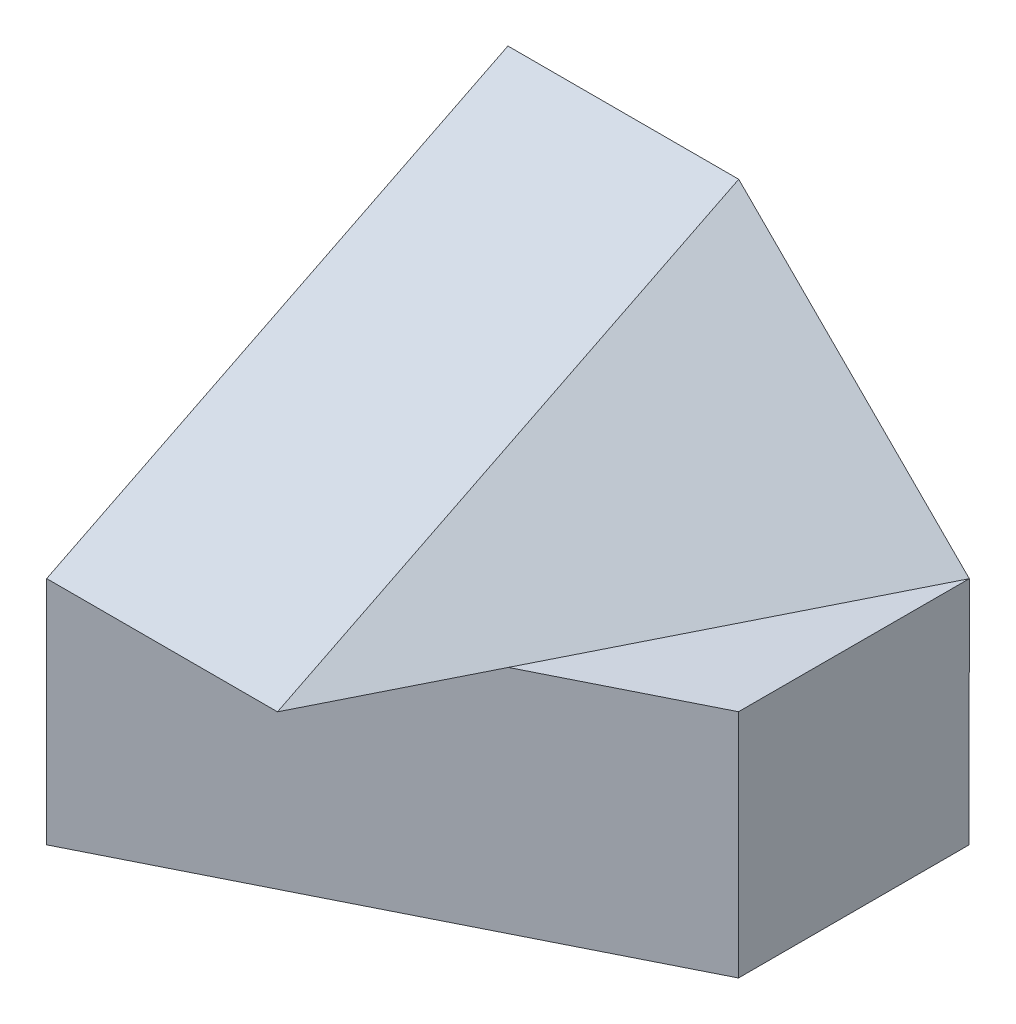
ISO-10303-21;
HEADER;
FILE_DESCRIPTION(('STEP AP214'),'2;1');
FILE_NAME('part.step','',(''),(''),'','','');
FILE_SCHEMA(('AUTOMOTIVE_DESIGN { 1 0 10303 214 1 1 1 1 }'));
ENDSEC;
DATA;
#1=APPLICATION_CONTEXT('core data for automotive mechanical design processes');
#2=APPLICATION_PROTOCOL_DEFINITION('international standard','automotive_design',2000,#1);
#3=PRODUCT_CONTEXT('',#1,'mechanical');
#4=PRODUCT('Part','Part','',(#3));
#5=PRODUCT_RELATED_PRODUCT_CATEGORY('part','',(#4));
#6=PRODUCT_DEFINITION_FORMATION('','',#4);
#7=PRODUCT_DEFINITION_CONTEXT('part definition',#1,'design');
#8=PRODUCT_DEFINITION('design','',#6,#7);
#9=PRODUCT_DEFINITION_SHAPE('','',#8);
#10=(LENGTH_UNIT() NAMED_UNIT(*) SI_UNIT(.MILLI.,.METRE.));
#11=(NAMED_UNIT(*) PLANE_ANGLE_UNIT() SI_UNIT($,.RADIAN.));
#12=(NAMED_UNIT(*) SI_UNIT($,.STERADIAN.) SOLID_ANGLE_UNIT());
#13=UNCERTAINTY_MEASURE_WITH_UNIT(LENGTH_MEASURE(1.E-05),#10,'distance_accuracy_value','');
#14=(GEOMETRIC_REPRESENTATION_CONTEXT(3) GLOBAL_UNCERTAINTY_ASSIGNED_CONTEXT((#13)) GLOBAL_UNIT_ASSIGNED_CONTEXT((#10,
#11,#12)) REPRESENTATION_CONTEXT('',''));
#15=CARTESIAN_POINT('',(0.,0.,0.));
#16=DIRECTION('',(0.,0.,1.));
#17=DIRECTION('',(1.,0.,0.));
#18=AXIS2_PLACEMENT_3D('',#15,#16,#17);
#19=CARTESIAN_POINT('',(0.,4.,-4.));
#20=DIRECTION('',(0.,0.894427190999916,0.447213595499958));
#21=DIRECTION('',(-1.,0.,0.));
#22=AXIS2_PLACEMENT_3D('',#19,#20,#21);
#23=PLANE('',#22);
#24=DIRECTION('',(-1.,0.,0.));
#25=VECTOR('',#24,1.);
#26=CARTESIAN_POINT('',(0.,2.,0.));
#27=LINE('',#26,#25);
#28=CARTESIAN_POINT('',(2.00174593778968,2.,0.));
#29=VERTEX_POINT('',#28);
#30=CARTESIAN_POINT('',(0.,2.,0.));
#31=VERTEX_POINT('',#30);
#32=EDGE_CURVE('E98',#29,#31,#27,.T.);
#33=ORIENTED_EDGE('',*,*,#32,.F.);
#34=DIRECTION('',(0.,0.447213595499958,-0.894427190999916));
#35=VECTOR('',#34,1.);
#36=CARTESIAN_POINT('',(2.00174593778968,2.,0.));
#37=LINE('',#36,#35);
#38=CARTESIAN_POINT('',(2.00174593778968,4.,-4.));
#39=VERTEX_POINT('',#38);
#40=EDGE_CURVE('E83',#29,#39,#37,.T.);
#41=ORIENTED_EDGE('',*,*,#40,.T.);
#42=DIRECTION('',(1.,0.,0.));
#43=VECTOR('',#42,1.);
#44=CARTESIAN_POINT('',(0.,4.,-4.));
#45=LINE('',#44,#43);
#46=CARTESIAN_POINT('',(0.,4.,-4.));
#47=VERTEX_POINT('',#46);
#48=EDGE_CURVE('E111',#47,#39,#45,.T.);
#49=ORIENTED_EDGE('',*,*,#48,.F.);
#50=DIRECTION('',(0.,0.447213595499958,-0.894427190999916));
#51=VECTOR('',#50,1.);
#52=CARTESIAN_POINT('',(0.,4.,-4.));
#53=LINE('',#52,#51);
#54=EDGE_CURVE('E105',#31,#47,#53,.T.);
#55=ORIENTED_EDGE('',*,*,#54,.F.);
#56=EDGE_LOOP('',(#33,#41,#49,#55));
#57=FACE_BOUND('',#56,.T.);
#58=ADVANCED_FACE('F36',(#57),#23,.T.);
#59=CARTESIAN_POINT('',(4.,2.,-2.));
#60=DIRECTION('',(-0.447213595499958,0.,-0.894427190999916));
#61=DIRECTION('',(-0.894427190999916,0.,0.447213595499958));
#62=AXIS2_PLACEMENT_3D('',#59,#60,#61);
#63=PLANE('',#62);
#64=DIRECTION('',(0.894427190999916,0.,-0.447213595499958));
#65=VECTOR('',#64,1.);
#66=CARTESIAN_POINT('',(4.,0.,-2.));
#67=LINE('',#66,#65);
#68=CARTESIAN_POINT('',(0.,0.,0.));
#69=VERTEX_POINT('',#68);
#70=CARTESIAN_POINT('',(4.,0.,-2.));
#71=VERTEX_POINT('',#70);
#72=EDGE_CURVE('E93',#69,#71,#67,.T.);
#73=ORIENTED_EDGE('',*,*,#72,.T.);
#74=DIRECTION('',(0.,-1.,0.));
#75=VECTOR('',#74,1.);
#76=CARTESIAN_POINT('',(4.,2.,-2.));
#77=LINE('',#76,#75);
#78=CARTESIAN_POINT('',(4.,2.,-2.));
#79=VERTEX_POINT('',#78);
#80=EDGE_CURVE('E127',#79,#71,#77,.T.);
#81=ORIENTED_EDGE('',*,*,#80,.F.);
#82=DIRECTION('',(0.894427190999916,0.,-0.447213595499958));
#83=VECTOR('',#82,1.);
#84=CARTESIAN_POINT('',(4.,2.,-2.));
#85=LINE('',#84,#83);
#86=CARTESIAN_POINT('',(2.66899458371957,2.,-1.33449729185978));
#87=VERTEX_POINT('',#86);
#88=EDGE_CURVE('E45',#87,#79,#85,.T.);
#89=ORIENTED_EDGE('',*,*,#88,.F.);
#90=DIRECTION('',(0.894427190999916,0.,-0.447213595499958));
#91=VECTOR('',#90,1.);
#92=CARTESIAN_POINT('',(4.,2.,-2.));
#93=LINE('',#92,#91);
#94=EDGE_CURVE('E101',#31,#87,#93,.T.);
#95=ORIENTED_EDGE('',*,*,#94,.F.);
#96=DIRECTION('',(0.,-1.,0.));
#97=VECTOR('',#96,1.);
#98=CARTESIAN_POINT('',(0.,2.,0.));
#99=LINE('',#98,#97);
#100=EDGE_CURVE('E133',#31,#69,#99,.T.);
#101=ORIENTED_EDGE('',*,*,#100,.T.);
#102=EDGE_LOOP('',(#73,#81,#89,#95,#101));
#103=FACE_BOUND('',#102,.T.);
#104=ADVANCED_FACE('F161',(#103),#63,.F.);
#105=CARTESIAN_POINT('',(4.,2.,-2.));
#106=DIRECTION('',(-1.,0.,0.));
#107=DIRECTION('',(0.,0.,1.));
#108=AXIS2_PLACEMENT_3D('',#105,#106,#107);
#109=PLANE('',#108);
#110=DIRECTION('',(0.,0.,-1.));
#111=VECTOR('',#110,1.);
#112=CARTESIAN_POINT('',(4.,0.,-2.));
#113=LINE('',#112,#111);
#114=CARTESIAN_POINT('',(4.,0.,-4.));
#115=VERTEX_POINT('',#114);
#116=EDGE_CURVE('E128',#71,#115,#113,.T.);
#117=ORIENTED_EDGE('',*,*,#116,.T.);
#118=DIRECTION('',(0.,-1.,0.));
#119=VECTOR('',#118,1.);
#120=CARTESIAN_POINT('',(4.,2.,-4.));
#121=LINE('',#120,#119);
#122=CARTESIAN_POINT('',(4.00174593778968,2.,-4.));
#123=VERTEX_POINT('',#122);
#124=EDGE_CURVE('E140',#123,#115,#121,.T.);
#125=ORIENTED_EDGE('',*,*,#124,.F.);
#126=DIRECTION('',(0.,0.,1.));
#127=VECTOR('',#126,1.);
#128=CARTESIAN_POINT('',(4.,2.,-2.));
#129=LINE('',#128,#127);
#130=EDGE_CURVE('E125',#123,#79,#129,.T.);
#131=ORIENTED_EDGE('',*,*,#130,.T.);
#132=ORIENTED_EDGE('',*,*,#80,.T.);
#133=EDGE_LOOP('',(#117,#125,#131,#132));
#134=FACE_BOUND('',#133,.T.);
#135=ADVANCED_FACE('F162',(#134),#109,.F.);
#136=CARTESIAN_POINT('',(4.,2.,-4.));
#137=DIRECTION('',(0.,0.,1.));
#138=DIRECTION('',(1.,0.,0.));
#139=AXIS2_PLACEMENT_3D('',#136,#137,#138);
#140=PLANE('',#139);
#141=ORIENTED_EDGE('',*,*,#48,.T.);
#142=DIRECTION('',(0.707106781186548,-0.707106781186548,0.));
#143=VECTOR('',#142,1.);
#144=CARTESIAN_POINT('',(4.00087296889484,2.00087296889484,-4.));
#145=LINE('',#144,#143);
#146=EDGE_CURVE('E88',#39,#123,#145,.T.);
#147=ORIENTED_EDGE('',*,*,#146,.T.);
#148=ORIENTED_EDGE('',*,*,#124,.T.);
#149=DIRECTION('',(-1.,0.,0.));
#150=VECTOR('',#149,1.);
#151=CARTESIAN_POINT('',(4.,0.,-4.));
#152=LINE('',#151,#150);
#153=CARTESIAN_POINT('',(0.,0.,-4.));
#154=VERTEX_POINT('',#153);
#155=EDGE_CURVE('E138',#115,#154,#152,.T.);
#156=ORIENTED_EDGE('',*,*,#155,.T.);
#157=DIRECTION('',(0.,-1.,0.));
#158=VECTOR('',#157,1.);
#159=CARTESIAN_POINT('',(0.,2.,-4.));
#160=LINE('',#159,#158);
#161=EDGE_CURVE('E141',#47,#154,#160,.T.);
#162=ORIENTED_EDGE('',*,*,#161,.F.);
#163=EDGE_LOOP('',(#141,#147,#148,#156,#162));
#164=FACE_BOUND('',#163,.T.);
#165=ADVANCED_FACE('F38',(#164),#140,.F.);
#166=CARTESIAN_POINT('',(0.,2.,0.));
#167=DIRECTION('',(1.,0.,0.));
#168=DIRECTION('',(0.,0.,-1.));
#169=AXIS2_PLACEMENT_3D('',#166,#167,#168);
#170=PLANE('',#169);
#171=ORIENTED_EDGE('',*,*,#100,.F.);
#172=ORIENTED_EDGE('',*,*,#54,.T.);
#173=ORIENTED_EDGE('',*,*,#161,.T.);
#174=DIRECTION('',(0.,0.,1.));
#175=VECTOR('',#174,1.);
#176=CARTESIAN_POINT('',(0.,0.,0.));
#177=LINE('',#176,#175);
#178=EDGE_CURVE('E102',#154,#69,#177,.T.);
#179=ORIENTED_EDGE('',*,*,#178,.T.);
#180=EDGE_LOOP('',(#171,#172,#173,#179));
#181=FACE_BOUND('',#180,.T.);
#182=ADVANCED_FACE('F155',(#181),#170,.F.);
#183=CARTESIAN_POINT('',(0.,0.,0.));
#184=DIRECTION('',(0.,-1.,0.));
#185=DIRECTION('',(0.,0.,-1.));
#186=AXIS2_PLACEMENT_3D('',#183,#184,#185);
#187=PLANE('',#186);
#188=ORIENTED_EDGE('',*,*,#72,.F.);
#189=ORIENTED_EDGE('',*,*,#178,.F.);
#190=ORIENTED_EDGE('',*,*,#155,.F.);
#191=ORIENTED_EDGE('',*,*,#116,.F.);
#192=EDGE_LOOP('',(#188,#189,#190,#191));
#193=FACE_BOUND('',#192,.T.);
#194=ADVANCED_FACE('F158',(#193),#187,.T.);
#195=CARTESIAN_POINT('',(0.,2.,0.));
#196=DIRECTION('',(0.,-1.,0.));
#197=DIRECTION('',(0.,0.,-1.));
#198=AXIS2_PLACEMENT_3D('',#195,#196,#197);
#199=PLANE('',#198);
#200=DIRECTION('',(-0.447213595499958,0.,0.894427190999916));
#201=VECTOR('',#200,1.);
#202=CARTESIAN_POINT('',(4.00174593778968,2.,-4.));
#203=LINE('',#202,#201);
#204=EDGE_CURVE('E86',#87,#29,#203,.T.);
#205=ORIENTED_EDGE('',*,*,#204,.T.);
#206=ORIENTED_EDGE('',*,*,#32,.T.);
#207=ORIENTED_EDGE('',*,*,#94,.T.);
#208=EDGE_LOOP('',(#205,#206,#207));
#209=FACE_BOUND('',#208,.T.);
#210=ADVANCED_FACE('F97',(#209),#199,.T.);
#211=CARTESIAN_POINT('',(1.77855375012874,1.77855375012874,0.889276875064373));
#212=DIRECTION('',(-0.666666666666667,-0.666666666666667,-0.333333333333334));
#213=DIRECTION('',(0.707106781186547,-0.707106781186548,0.));
#214=AXIS2_PLACEMENT_3D('',#211,#212,#213);
#215=PLANE('',#214);
#216=ORIENTED_EDGE('',*,*,#146,.F.);
#217=ORIENTED_EDGE('',*,*,#40,.F.);
#218=ORIENTED_EDGE('',*,*,#204,.F.);
#219=EDGE_CURVE('E13',#123,#87,#203,.T.);
#220=ORIENTED_EDGE('',*,*,#219,.F.);
#221=EDGE_LOOP('',(#216,#217,#218,#220));
#222=FACE_BOUND('',#221,.T.);
#223=ADVANCED_FACE('F85',(#222),#215,.F.);
#224=CARTESIAN_POINT('',(4.00174593778968,2.,-4.));
#225=DIRECTION('',(0.,1.,0.));
#226=DIRECTION('',(0.,0.,1.));
#227=AXIS2_PLACEMENT_3D('',#224,#225,#226);
#228=PLANE('',#227);
#229=ORIENTED_EDGE('',*,*,#88,.T.);
#230=ORIENTED_EDGE('',*,*,#130,.F.);
#231=ORIENTED_EDGE('',*,*,#219,.T.);
#232=EDGE_LOOP('',(#229,#230,#231));
#233=FACE_BOUND('',#232,.T.);
#234=ADVANCED_FACE('F175',(#233),#228,.T.);
#235=CLOSED_SHELL('',(#58,#104,#135,#165,#182,#194,#210,#223,#234));
#236=MANIFOLD_SOLID_BREP('B2',#235);
#237=ADVANCED_BREP_SHAPE_REPRESENTATION('',(#18,#236),#14);
#238=SHAPE_DEFINITION_REPRESENTATION(#9,#237);
ENDSEC;
END-ISO-10303-21;
